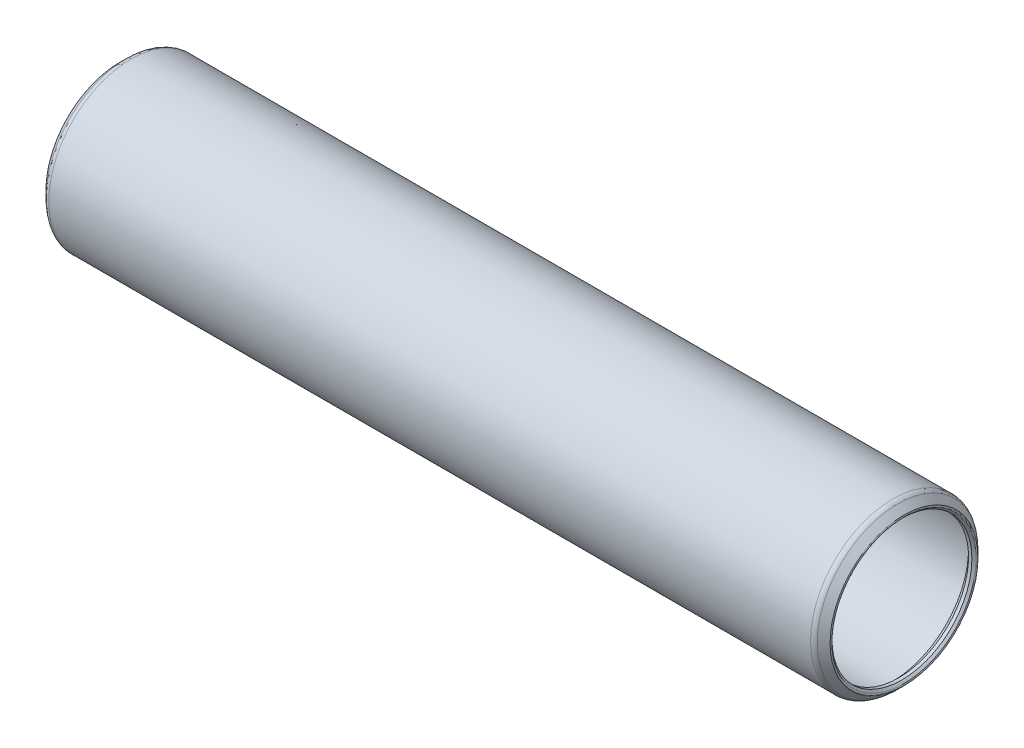
ISO-10303-21;
HEADER;
FILE_DESCRIPTION(('STEP AP214'),'2;1');
FILE_NAME('part.step','',(''),(''),'','','');
FILE_SCHEMA(('AUTOMOTIVE_DESIGN { 1 0 10303 214 1 1 1 1 }'));
ENDSEC;
DATA;
#1=APPLICATION_CONTEXT('core data for automotive mechanical design processes');
#2=APPLICATION_PROTOCOL_DEFINITION('international standard','automotive_design',2000,#1);
#3=PRODUCT_CONTEXT('',#1,'mechanical');
#4=PRODUCT('Part','Part','',(#3));
#5=PRODUCT_RELATED_PRODUCT_CATEGORY('part','',(#4));
#6=PRODUCT_DEFINITION_FORMATION('','',#4);
#7=PRODUCT_DEFINITION_CONTEXT('part definition',#1,'design');
#8=PRODUCT_DEFINITION('design','',#6,#7);
#9=PRODUCT_DEFINITION_SHAPE('','',#8);
#10=(LENGTH_UNIT() NAMED_UNIT(*) SI_UNIT(.MILLI.,.METRE.));
#11=(NAMED_UNIT(*) PLANE_ANGLE_UNIT() SI_UNIT($,.RADIAN.));
#12=(NAMED_UNIT(*) SI_UNIT($,.STERADIAN.) SOLID_ANGLE_UNIT());
#13=UNCERTAINTY_MEASURE_WITH_UNIT(LENGTH_MEASURE(1.E-05),#10,'distance_accuracy_value','');
#14=(GEOMETRIC_REPRESENTATION_CONTEXT(3) GLOBAL_UNCERTAINTY_ASSIGNED_CONTEXT((#13)) GLOBAL_UNIT_ASSIGNED_CONTEXT((#10,
#11,#12)) REPRESENTATION_CONTEXT('',''));
#15=CARTESIAN_POINT('',(0.,0.,0.));
#16=DIRECTION('',(0.,0.,1.));
#17=DIRECTION('',(1.,0.,0.));
#18=AXIS2_PLACEMENT_3D('',#15,#16,#17);
#19=CARTESIAN_POINT('',(73.3298,0.,0.));
#20=DIRECTION('',(-1.,0.,0.));
#21=DIRECTION('',(0.,0.,1.));
#22=AXIS2_PLACEMENT_3D('',#19,#20,#21);
#23=CYLINDRICAL_SURFACE('',#22,7.27075);
#24=CARTESIAN_POINT('',(0.634999999988395,0.,0.));
#25=DIRECTION('',(1.,0.,0.));
#26=DIRECTION('',(0.,0.,-1.));
#27=AXIS2_PLACEMENT_3D('',#24,#25,#26);
#28=CIRCLE('',#27,7.27074999997512);
#29=CARTESIAN_POINT('',(0.634999999988395,0.,-7.27074999997512));
#30=VERTEX_POINT('',#29);
#31=EDGE_CURVE('E117',#30,#30,#28,.F.);
#32=ORIENTED_EDGE('',*,*,#31,.T.);
#33=EDGE_LOOP('',(#32));
#34=FACE_BOUND('',#33,.T.);
#35=CARTESIAN_POINT('',(72.6948,0.,0.));
#36=DIRECTION('',(-1.,0.,0.));
#37=DIRECTION('',(0.,0.,1.));
#38=AXIS2_PLACEMENT_3D('',#35,#36,#37);
#39=CIRCLE('',#38,7.27075);
#40=CARTESIAN_POINT('',(72.6948,0.,7.27075));
#41=VERTEX_POINT('',#40);
#42=EDGE_CURVE('E112',#41,#41,#39,.F.);
#43=ORIENTED_EDGE('',*,*,#42,.T.);
#44=EDGE_LOOP('',(#43));
#45=FACE_BOUND('',#44,.T.);
#46=ADVANCED_FACE('F15',(#34,#45),#23,.F.);
#47=CARTESIAN_POINT('',(0.634999999988395,0.,0.));
#48=DIRECTION('',(1.,0.,0.));
#49=DIRECTION('',(0.,0.,-1.));
#50=AXIS2_PLACEMENT_3D('',#47,#48,#49);
#51=CONICAL_SURFACE('',#50,7.27074999997512,0.785398163397448);
#52=CARTESIAN_POINT('',(0.,0.,0.));
#53=DIRECTION('',(-1.,0.,0.));
#54=DIRECTION('',(0.,0.,1.));
#55=AXIS2_PLACEMENT_3D('',#52,#53,#54);
#56=CIRCLE('',#55,6.63575);
#57=CARTESIAN_POINT('',(0.,0.,6.63575));
#58=VERTEX_POINT('',#57);
#59=EDGE_CURVE('E107',#58,#58,#56,.T.);
#60=ORIENTED_EDGE('',*,*,#59,.T.);
#61=EDGE_LOOP('',(#60));
#62=FACE_BOUND('',#61,.T.);
#63=ORIENTED_EDGE('',*,*,#31,.F.);
#64=EDGE_LOOP('',(#63));
#65=FACE_BOUND('',#64,.T.);
#66=ADVANCED_FACE('F124',(#62,#65),#51,.F.);
#67=CARTESIAN_POINT('',(72.6948,0.,0.));
#68=DIRECTION('',(-1.,0.,0.));
#69=DIRECTION('',(0.,0.,1.));
#70=AXIS2_PLACEMENT_3D('',#67,#68,#69);
#71=CONICAL_SURFACE('',#70,7.27075,0.785398163397451);
#72=ORIENTED_EDGE('',*,*,#42,.F.);
#73=EDGE_LOOP('',(#72));
#74=FACE_BOUND('',#73,.T.);
#75=CARTESIAN_POINT('',(73.3298,0.,0.));
#76=DIRECTION('',(-1.,0.,0.));
#77=DIRECTION('',(0.,0.,1.));
#78=AXIS2_PLACEMENT_3D('',#75,#76,#77);
#79=CIRCLE('',#78,6.63575);
#80=CARTESIAN_POINT('',(73.3298,0.,6.63575));
#81=VERTEX_POINT('',#80);
#82=EDGE_CURVE('E102',#81,#81,#79,.F.);
#83=ORIENTED_EDGE('',*,*,#82,.T.);
#84=EDGE_LOOP('',(#83));
#85=FACE_BOUND('',#84,.T.);
#86=ADVANCED_FACE('F126',(#74,#85),#71,.F.);
#87=CARTESIAN_POINT('',(73.3298,0.,0.));
#88=DIRECTION('',(-1.,0.,0.));
#89=DIRECTION('',(0.,0.,1.));
#90=AXIS2_PLACEMENT_3D('',#87,#88,#89);
#91=CYLINDRICAL_SURFACE('',#90,6.63575);
#92=CARTESIAN_POINT('',(-0.317499999937354,0.,0.));
#93=DIRECTION('',(-1.,0.,0.));
#94=DIRECTION('',(0.,0.,1.));
#95=AXIS2_PLACEMENT_3D('',#92,#93,#94);
#96=CIRCLE('',#95,6.63574999998673);
#97=CARTESIAN_POINT('',(-0.317499999937354,0.,6.63574999998673));
#98=VERTEX_POINT('',#97);
#99=EDGE_CURVE('E97',#98,#98,#96,.T.);
#100=ORIENTED_EDGE('',*,*,#99,.T.);
#101=EDGE_LOOP('',(#100));
#102=FACE_BOUND('',#101,.T.);
#103=ORIENTED_EDGE('',*,*,#59,.F.);
#104=EDGE_LOOP('',(#103));
#105=FACE_BOUND('',#104,.T.);
#106=ADVANCED_FACE('F133',(#102,#105),#91,.F.);
#107=CARTESIAN_POINT('',(73.3298,0.,0.));
#108=DIRECTION('',(-1.,0.,0.));
#109=DIRECTION('',(0.,0.,1.));
#110=AXIS2_PLACEMENT_3D('',#107,#108,#109);
#111=CYLINDRICAL_SURFACE('',#110,6.63575);
#112=ORIENTED_EDGE('',*,*,#82,.F.);
#113=EDGE_LOOP('',(#112));
#114=FACE_BOUND('',#113,.T.);
#115=CARTESIAN_POINT('',(73.6473000000046,0.,0.));
#116=DIRECTION('',(1.,0.,0.));
#117=DIRECTION('',(0.,0.,-1.));
#118=AXIS2_PLACEMENT_3D('',#115,#116,#117);
#119=CIRCLE('',#118,6.63574999998673);
#120=CARTESIAN_POINT('',(73.6473000000046,0.,-6.63574999998673));
#121=VERTEX_POINT('',#120);
#122=EDGE_CURVE('E92',#121,#121,#119,.T.);
#123=ORIENTED_EDGE('',*,*,#122,.T.);
#124=EDGE_LOOP('',(#123));
#125=FACE_BOUND('',#124,.T.);
#126=ADVANCED_FACE('F153',(#114,#125),#111,.F.);
#127=CARTESIAN_POINT('',(-0.517960244792448,0.,0.));
#128=DIRECTION('',(-1.,0.,0.));
#129=DIRECTION('',(0.,0.,1.));
#130=AXIS2_PLACEMENT_3D('',#127,#128,#129);
#131=CONICAL_SURFACE('',#130,6.83621024478498,0.785398163397448);
#132=CARTESIAN_POINT('',(-0.517960244842765,0.,0.));
#133=DIRECTION('',(1.,0.,0.));
#134=DIRECTION('',(0.,0.,-1.));
#135=AXIS2_PLACEMENT_3D('',#132,#133,#134);
#136=CIRCLE('',#135,6.83621024484277);
#137=CARTESIAN_POINT('',(-0.517960244842765,0.,-6.83621024484277));
#138=VERTEX_POINT('',#137);
#139=EDGE_CURVE('E89',#138,#138,#136,.T.);
#140=ORIENTED_EDGE('',*,*,#139,.F.);
#141=EDGE_LOOP('',(#140));
#142=FACE_BOUND('',#141,.T.);
#143=ORIENTED_EDGE('',*,*,#99,.F.);
#144=EDGE_LOOP('',(#143));
#145=FACE_BOUND('',#144,.T.);
#146=ADVANCED_FACE('F150',(#142,#145),#131,.F.);
#147=CARTESIAN_POINT('',(73.847760244746,0.,0.));
#148=DIRECTION('',(1.,0.,0.));
#149=DIRECTION('',(0.,0.,-1.));
#150=AXIS2_PLACEMENT_3D('',#147,#148,#149);
#151=CONICAL_SURFACE('',#150,6.83621024472814,0.785398163255666);
#152=ORIENTED_EDGE('',*,*,#122,.F.);
#153=EDGE_LOOP('',(#152));
#154=FACE_BOUND('',#153,.T.);
#155=CARTESIAN_POINT('',(73.8477602448428,0.,0.));
#156=DIRECTION('',(1.,0.,0.));
#157=DIRECTION('',(0.,0.,-1.));
#158=AXIS2_PLACEMENT_3D('',#155,#156,#157);
#159=CIRCLE('',#158,6.8362102448427);
#160=CARTESIAN_POINT('',(73.8477602448428,0.,-6.8362102448427));
#161=VERTEX_POINT('',#160);
#162=EDGE_CURVE('E67',#161,#161,#159,.F.);
#163=ORIENTED_EDGE('',*,*,#162,.F.);
#164=EDGE_LOOP('',(#163));
#165=FACE_BOUND('',#164,.T.);
#166=ADVANCED_FACE('F83',(#154,#165),#151,.F.);
#167=CARTESIAN_POINT('',(-0.428157683632077,0.,0.));
#168=DIRECTION('',(1.,0.,0.));
#169=DIRECTION('',(0.,0.,-1.));
#170=AXIS2_PLACEMENT_3D('',#167,#168,#169);
#171=TOROIDAL_SURFACE('',#170,6.92601280605346,0.126999999999998);
#172=CARTESIAN_POINT('',(-0.517960244842778,0.,0.));
#173=DIRECTION('',(1.,0.,0.));
#174=DIRECTION('',(0.,0.,-1.));
#175=AXIS2_PLACEMENT_3D('',#172,#173,#174);
#176=CIRCLE('',#175,7.01581536726415);
#177=CARTESIAN_POINT('',(-0.517960244842778,0.,-7.01581536726415));
#178=VERTEX_POINT('',#177);
#179=EDGE_CURVE('E62',#178,#178,#176,.T.);
#180=ORIENTED_EDGE('',*,*,#179,.F.);
#181=EDGE_LOOP('',(#180));
#182=FACE_BOUND('',#181,.T.);
#183=ORIENTED_EDGE('',*,*,#139,.T.);
#184=EDGE_LOOP('',(#183));
#185=FACE_BOUND('',#184,.T.);
#186=ADVANCED_FACE('F78',(#182,#185),#171,.T.);
#187=CARTESIAN_POINT('',(73.7579576836321,0.,0.));
#188=DIRECTION('',(1.,0.,0.));
#189=DIRECTION('',(0.,0.,-1.));
#190=AXIS2_PLACEMENT_3D('',#187,#188,#189);
#191=TOROIDAL_SURFACE('',#190,6.92601280605346,0.127000000000041);
#192=ORIENTED_EDGE('',*,*,#162,.T.);
#193=EDGE_LOOP('',(#192));
#194=FACE_BOUND('',#193,.T.);
#195=CARTESIAN_POINT('',(73.8477602448427,0.,0.));
#196=DIRECTION('',(-1.,0.,0.));
#197=DIRECTION('',(0.,0.,1.));
#198=AXIS2_PLACEMENT_3D('',#195,#196,#197);
#199=CIRCLE('',#198,7.01581536726416);
#200=CARTESIAN_POINT('',(73.8477602448427,0.,7.01581536726416));
#201=VERTEX_POINT('',#200);
#202=EDGE_CURVE('E57',#201,#201,#199,.T.);
#203=ORIENTED_EDGE('',*,*,#202,.F.);
#204=EDGE_LOOP('',(#203));
#205=FACE_BOUND('',#204,.T.);
#206=ADVANCED_FACE('F74',(#194,#205),#191,.T.);
#207=CARTESIAN_POINT('',(0.0907371939465477,0.,0.));
#208=DIRECTION('',(1.,0.,0.));
#209=DIRECTION('',(0.,1.,0.));
#210=AXIS2_PLACEMENT_3D('',#207,#208,#209);
#211=CONICAL_SURFACE('',#210,7.62451280605347,0.785398163397442);
#212=CARTESIAN_POINT('',(0.0907371939465523,0.,0.));
#213=DIRECTION('',(1.,0.,0.));
#214=DIRECTION('',(0.,0.,-1.));
#215=AXIS2_PLACEMENT_3D('',#212,#213,#214);
#216=CIRCLE('',#215,7.62451280605346);
#217=CARTESIAN_POINT('',(0.0907371939465523,0.,-7.62451280605346));
#218=VERTEX_POINT('',#217);
#219=EDGE_CURVE('E54',#218,#218,#216,.T.);
#220=ORIENTED_EDGE('',*,*,#219,.F.);
#221=EDGE_LOOP('',(#220));
#222=FACE_BOUND('',#221,.T.);
#223=ORIENTED_EDGE('',*,*,#179,.T.);
#224=EDGE_LOOP('',(#223));
#225=FACE_BOUND('',#224,.T.);
#226=ADVANCED_FACE('F77',(#222,#225),#211,.T.);
#227=CARTESIAN_POINT('',(73.2390628060534,0.,0.));
#228=DIRECTION('',(-1.,0.,0.));
#229=DIRECTION('',(0.,0.,1.));
#230=AXIS2_PLACEMENT_3D('',#227,#228,#229);
#231=CONICAL_SURFACE('',#230,7.6245128060535,0.785398163397438);
#232=ORIENTED_EDGE('',*,*,#202,.T.);
#233=EDGE_LOOP('',(#232));
#234=FACE_BOUND('',#233,.T.);
#235=CARTESIAN_POINT('',(73.2390628060534,0.,0.));
#236=DIRECTION('',(1.,0.,0.));
#237=DIRECTION('',(0.,0.,-1.));
#238=AXIS2_PLACEMENT_3D('',#235,#236,#237);
#239=CIRCLE('',#238,7.6245128060535);
#240=CARTESIAN_POINT('',(73.2390628060534,0.,-7.6245128060535));
#241=VERTEX_POINT('',#240);
#242=EDGE_CURVE('E27',#241,#241,#239,.F.);
#243=ORIENTED_EDGE('',*,*,#242,.F.);
#244=EDGE_LOOP('',(#243));
#245=FACE_BOUND('',#244,.T.);
#246=ADVANCED_FACE('F48',(#234,#245),#231,.T.);
#247=CARTESIAN_POINT('',(0.539749999999995,0.,0.));
#248=DIRECTION('',(1.,0.,0.));
#249=DIRECTION('',(0.,0.,-1.));
#250=AXIS2_PLACEMENT_3D('',#247,#248,#249);
#251=TOROIDAL_SURFACE('',#250,7.1755,0.634999999999992);
#252=CARTESIAN_POINT('',(0.539749999999992,0.,0.));
#253=DIRECTION('',(-1.,0.,0.));
#254=DIRECTION('',(0.,0.,1.));
#255=AXIS2_PLACEMENT_3D('',#252,#253,#254);
#256=CIRCLE('',#255,7.8105);
#257=CARTESIAN_POINT('',(0.539749999999992,0.,7.8105));
#258=VERTEX_POINT('',#257);
#259=EDGE_CURVE('E22',#258,#258,#256,.F.);
#260=ORIENTED_EDGE('',*,*,#259,.F.);
#261=EDGE_LOOP('',(#260));
#262=FACE_BOUND('',#261,.T.);
#263=ORIENTED_EDGE('',*,*,#219,.T.);
#264=EDGE_LOOP('',(#263));
#265=FACE_BOUND('',#264,.T.);
#266=ADVANCED_FACE('F43',(#262,#265),#251,.T.);
#267=CARTESIAN_POINT('',(72.79005,0.,0.));
#268=DIRECTION('',(1.,0.,0.));
#269=DIRECTION('',(0.,0.,-1.));
#270=AXIS2_PLACEMENT_3D('',#267,#268,#269);
#271=TOROIDAL_SURFACE('',#270,7.1755,0.634999999999987);
#272=ORIENTED_EDGE('',*,*,#242,.T.);
#273=EDGE_LOOP('',(#272));
#274=FACE_BOUND('',#273,.T.);
#275=CARTESIAN_POINT('',(72.79005,0.,0.));
#276=DIRECTION('',(-1.,0.,0.));
#277=DIRECTION('',(0.,0.,1.));
#278=AXIS2_PLACEMENT_3D('',#275,#276,#277);
#279=CIRCLE('',#278,7.8105);
#280=CARTESIAN_POINT('',(72.79005,0.,7.8105));
#281=VERTEX_POINT('',#280);
#282=EDGE_CURVE('E10',#281,#281,#279,.T.);
#283=ORIENTED_EDGE('',*,*,#282,.F.);
#284=EDGE_LOOP('',(#283));
#285=FACE_BOUND('',#284,.T.);
#286=ADVANCED_FACE('F38',(#274,#285),#271,.T.);
#287=CARTESIAN_POINT('',(73.3298,0.,0.));
#288=DIRECTION('',(-1.,0.,0.));
#289=DIRECTION('',(0.,0.,1.));
#290=AXIS2_PLACEMENT_3D('',#287,#288,#289);
#291=CYLINDRICAL_SURFACE('',#290,7.8105);
#292=ORIENTED_EDGE('',*,*,#282,.T.);
#293=EDGE_LOOP('',(#292));
#294=FACE_BOUND('',#293,.T.);
#295=ORIENTED_EDGE('',*,*,#259,.T.);
#296=EDGE_LOOP('',(#295));
#297=FACE_BOUND('',#296,.T.);
#298=ADVANCED_FACE('F42',(#294,#297),#291,.T.);
#299=CLOSED_SHELL('',(#46,#66,#86,#106,#126,#146,#166,#186,#206,#226,#246,#266,#286,#298));
#300=MANIFOLD_SOLID_BREP('B1',#299);
#301=ADVANCED_BREP_SHAPE_REPRESENTATION('',(#18,#300),#14);
#302=SHAPE_DEFINITION_REPRESENTATION(#9,#301);
ENDSEC;
END-ISO-10303-21;
